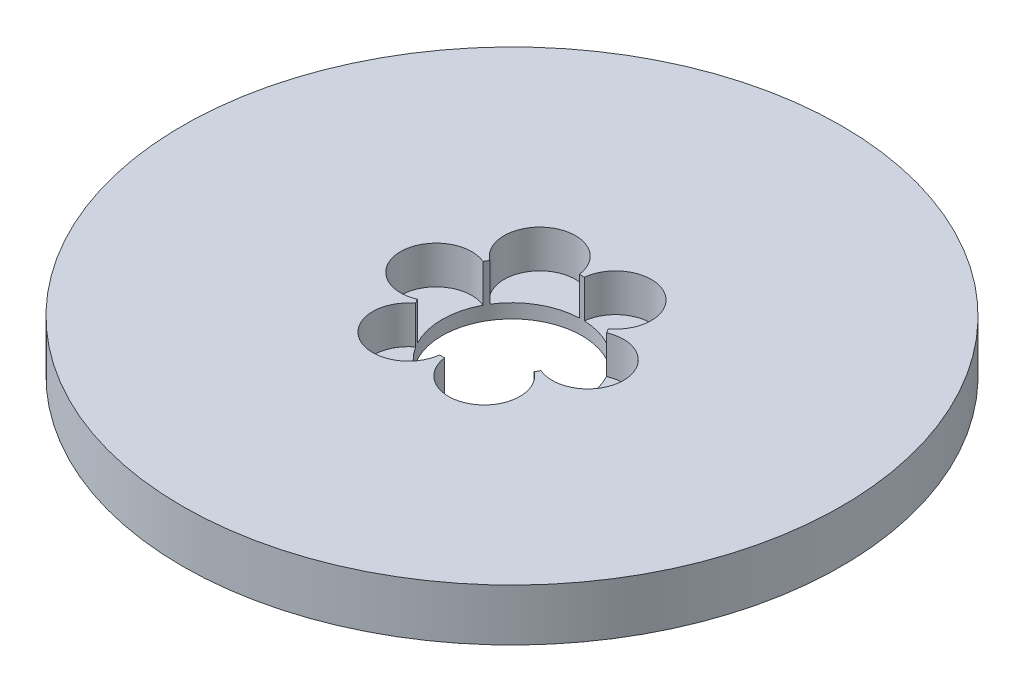
ISO-10303-21;
HEADER;
FILE_DESCRIPTION(('STEP AP214'),'2;1');
FILE_NAME('part.step','',(''),(''),'','','');
FILE_SCHEMA(('AUTOMOTIVE_DESIGN { 1 0 10303 214 1 1 1 1 }'));
ENDSEC;
DATA;
#1=APPLICATION_CONTEXT('core data for automotive mechanical design processes');
#2=APPLICATION_PROTOCOL_DEFINITION('international standard','automotive_design',2000,#1);
#3=PRODUCT_CONTEXT('',#1,'mechanical');
#4=PRODUCT('Part','Part','',(#3));
#5=PRODUCT_RELATED_PRODUCT_CATEGORY('part','',(#4));
#6=PRODUCT_DEFINITION_FORMATION('','',#4);
#7=PRODUCT_DEFINITION_CONTEXT('part definition',#1,'design');
#8=PRODUCT_DEFINITION('design','',#6,#7);
#9=PRODUCT_DEFINITION_SHAPE('','',#8);
#10=(LENGTH_UNIT() NAMED_UNIT(*) SI_UNIT(.MILLI.,.METRE.));
#11=(NAMED_UNIT(*) PLANE_ANGLE_UNIT() SI_UNIT($,.RADIAN.));
#12=(NAMED_UNIT(*) SI_UNIT($,.STERADIAN.) SOLID_ANGLE_UNIT());
#13=UNCERTAINTY_MEASURE_WITH_UNIT(LENGTH_MEASURE(1.E-05),#10,'distance_accuracy_value','');
#14=(GEOMETRIC_REPRESENTATION_CONTEXT(3) GLOBAL_UNCERTAINTY_ASSIGNED_CONTEXT((#13)) GLOBAL_UNIT_ASSIGNED_CONTEXT((#10,
#11,#12)) REPRESENTATION_CONTEXT('',''));
#15=CARTESIAN_POINT('',(0.,0.,0.));
#16=DIRECTION('',(0.,0.,1.));
#17=DIRECTION('',(1.,0.,0.));
#18=AXIS2_PLACEMENT_3D('',#15,#16,#17);
#19=CARTESIAN_POINT('',(0.,13.,0.));
#20=DIRECTION('',(0.,-1.,0.));
#21=DIRECTION('',(0.,0.,-1.));
#22=AXIS2_PLACEMENT_3D('',#19,#20,#21);
#23=CYLINDRICAL_SURFACE('',#22,82.5);
#24=CARTESIAN_POINT('',(0.,13.,0.));
#25=DIRECTION('',(0.,1.,0.));
#26=DIRECTION('',(0.,0.,1.));
#27=AXIS2_PLACEMENT_3D('',#24,#25,#26);
#28=CIRCLE('',#27,82.5);
#29=CARTESIAN_POINT('',(0.,13.,-82.5));
#30=VERTEX_POINT('',#29);
#31=EDGE_CURVE('E168',#30,#30,#28,.T.);
#32=CARTESIAN_POINT('',(0.,0.,0.));
#33=DIRECTION('',(0.,1.,0.));
#34=DIRECTION('',(0.,0.,1.));
#35=AXIS2_PLACEMENT_3D('',#32,#33,#34);
#36=CIRCLE('',#35,82.5);
#37=CARTESIAN_POINT('',(0.,0.,-82.5));
#38=VERTEX_POINT('',#37);
#39=EDGE_CURVE('E158',#38,#38,#36,.T.);
#40=CARTESIAN_POINT('',(0.,13.,-82.5));
#41=CARTESIAN_POINT('',(0.,12.8645833333333,-82.5));
#42=CARTESIAN_POINT('',(0.,12.7291666666667,-82.5));
#43=CARTESIAN_POINT('',(0.,12.4583333333333,-82.5));
#44=CARTESIAN_POINT('',(0.,12.3229166666667,-82.5));
#45=CARTESIAN_POINT('',(0.,12.0520833333333,-82.5));
#46=CARTESIAN_POINT('',(0.,11.9166666666667,-82.5));
#47=CARTESIAN_POINT('',(0.,11.6458333333333,-82.5));
#48=CARTESIAN_POINT('',(0.,11.5104166666667,-82.5));
#49=CARTESIAN_POINT('',(0.,11.2395833333333,-82.5));
#50=CARTESIAN_POINT('',(0.,11.1041666666667,-82.5));
#51=CARTESIAN_POINT('',(0.,10.8333333333333,-82.5));
#52=CARTESIAN_POINT('',(0.,10.6979166666667,-82.5));
#53=CARTESIAN_POINT('',(0.,10.4270833333333,-82.5));
#54=CARTESIAN_POINT('',(0.,10.2916666666667,-82.5));
#55=CARTESIAN_POINT('',(0.,10.0208333333333,-82.5));
#56=CARTESIAN_POINT('',(0.,9.88541666666667,-82.5));
#57=CARTESIAN_POINT('',(0.,9.61458333333333,-82.5));
#58=CARTESIAN_POINT('',(0.,9.47916666666667,-82.5));
#59=CARTESIAN_POINT('',(0.,9.20833333333333,-82.5));
#60=CARTESIAN_POINT('',(0.,9.07291666666667,-82.5));
#61=CARTESIAN_POINT('',(0.,8.80208333333333,-82.5));
#62=CARTESIAN_POINT('',(0.,8.66666666666667,-82.5));
#63=CARTESIAN_POINT('',(0.,8.39583333333333,-82.5));
#64=CARTESIAN_POINT('',(0.,8.26041666666667,-82.5));
#65=CARTESIAN_POINT('',(0.,7.98958333333333,-82.5));
#66=CARTESIAN_POINT('',(0.,7.85416666666667,-82.5));
#67=CARTESIAN_POINT('',(0.,7.58333333333333,-82.5));
#68=CARTESIAN_POINT('',(0.,7.44791666666667,-82.5));
#69=CARTESIAN_POINT('',(0.,7.17708333333333,-82.5));
#70=CARTESIAN_POINT('',(0.,7.04166666666667,-82.5));
#71=CARTESIAN_POINT('',(0.,6.77083333333333,-82.5));
#72=CARTESIAN_POINT('',(0.,6.63541666666667,-82.5));
#73=CARTESIAN_POINT('',(0.,6.36458333333333,-82.5));
#74=CARTESIAN_POINT('',(0.,6.22916666666667,-82.5));
#75=CARTESIAN_POINT('',(0.,5.95833333333333,-82.5));
#76=CARTESIAN_POINT('',(0.,5.82291666666667,-82.5));
#77=CARTESIAN_POINT('',(0.,5.55208333333333,-82.5));
#78=CARTESIAN_POINT('',(0.,5.41666666666667,-82.5));
#79=CARTESIAN_POINT('',(0.,5.14583333333333,-82.5));
#80=CARTESIAN_POINT('',(0.,5.01041666666667,-82.5));
#81=CARTESIAN_POINT('',(0.,4.73958333333333,-82.5));
#82=CARTESIAN_POINT('',(0.,4.60416666666667,-82.5));
#83=CARTESIAN_POINT('',(0.,4.33333333333333,-82.5));
#84=CARTESIAN_POINT('',(0.,4.19791666666667,-82.5));
#85=CARTESIAN_POINT('',(0.,3.92708333333333,-82.5));
#86=CARTESIAN_POINT('',(0.,3.79166666666667,-82.5));
#87=CARTESIAN_POINT('',(0.,3.52083333333333,-82.5));
#88=CARTESIAN_POINT('',(0.,3.38541666666667,-82.5));
#89=CARTESIAN_POINT('',(0.,3.11458333333333,-82.5));
#90=CARTESIAN_POINT('',(0.,2.97916666666667,-82.5));
#91=CARTESIAN_POINT('',(0.,2.70833333333333,-82.5));
#92=CARTESIAN_POINT('',(0.,2.57291666666667,-82.5));
#93=CARTESIAN_POINT('',(0.,2.30208333333333,-82.5));
#94=CARTESIAN_POINT('',(0.,2.16666666666667,-82.5));
#95=CARTESIAN_POINT('',(0.,1.89583333333333,-82.5));
#96=CARTESIAN_POINT('',(0.,1.76041666666667,-82.5));
#97=CARTESIAN_POINT('',(0.,1.48958333333333,-82.5));
#98=CARTESIAN_POINT('',(0.,1.35416666666667,-82.5));
#99=CARTESIAN_POINT('',(0.,1.08333333333333,-82.5));
#100=CARTESIAN_POINT('',(0.,0.947916666666667,-82.5));
#101=CARTESIAN_POINT('',(0.,0.677083333333334,-82.5));
#102=CARTESIAN_POINT('',(0.,0.541666666666667,-82.5));
#103=CARTESIAN_POINT('',(0.,0.270833333333334,-82.5));
#104=CARTESIAN_POINT('',(0.,0.135416666666667,-82.5));
#105=CARTESIAN_POINT('',(0.,0.,-82.5));
#106=B_SPLINE_CURVE_WITH_KNOTS('',3,(#40,#41,#42,#43,#44,#45,#46,#47,#48,#49,#50,#51,#52,#53,
#54,#55,#56,#57,#58,#59,#60,#61,#62,#63,#64,#65,#66,#67,#68,#69,#70,#71,#72,#73,#74,#75,#76,#77,
#78,#79,#80,#81,#82,#83,#84,#85,#86,#87,#88,#89,#90,#91,#92,#93,#94,#95,#96,#97,#98,#99,#100,
#101,#102,#103,#104,#105),.UNSPECIFIED.,.F.,.F.,(4,2,2,2,2,2,2,2,2,2,2,2,2,2,2,2,2,2,2,2,2,2,2,
2,2,2,2,2,2,2,2,2,4),(0.,0.406249999999999,0.812499999999999,1.21875,1.625,2.03125,2.4375,
2.84375,3.25,3.65625,4.0625,4.46875,4.875,5.28125,5.6875,6.09375,6.5,6.90625,7.3125,7.71875,
8.125,8.53125,8.9375,9.34375,9.75,10.15625,10.5625,10.96875,11.375,11.78125,12.1875,12.59375,
13.),.UNSPECIFIED.);
#107=EDGE_CURVE('BSEAM39',#30,#38,#106,.T.);
#108=ORIENTED_EDGE('',*,*,#31,.F.);
#109=ORIENTED_EDGE('',*,*,#39,.T.);
#110=ORIENTED_EDGE('',*,*,#107,.T.);
#111=ORIENTED_EDGE('',*,*,#107,.F.);
#112=EDGE_LOOP('',(#108,#110,#109,#111));
#113=FACE_BOUND('',#112,.T.);
#114=ADVANCED_FACE('F39',(#113),#23,.T.);
#115=CARTESIAN_POINT('',(0.,13.,0.));
#116=DIRECTION('',(0.,1.,0.));
#117=DIRECTION('',(0.,0.,1.));
#118=AXIS2_PLACEMENT_3D('',#115,#116,#117);
#119=PLANE('',#118);
#120=CARTESIAN_POINT('',(18.9891539759738,13.,0.));
#121=DIRECTION('',(0.,1.,0.));
#122=DIRECTION('',(0.,0.,-1.));
#123=AXIS2_PLACEMENT_3D('',#120,#121,#122);
#124=CIRCLE('',#123,8.93165951929688);
#125=CARTESIAN_POINT('',(15.4578615692248,13.,8.20393294138144));
#126=VERTEX_POINT('',#125);
#127=CARTESIAN_POINT('',(15.4578615692248,13.,-8.20393294138144));
#128=VERTEX_POINT('',#127);
#129=EDGE_CURVE('E212',#126,#128,#124,.T.);
#130=ORIENTED_EDGE('',*,*,#129,.F.);
#131=CARTESIAN_POINT('',(0.,13.,0.));
#132=DIRECTION('',(0.,1.,0.));
#133=DIRECTION('',(0.,0.,1.));
#134=AXIS2_PLACEMENT_3D('',#131,#132,#133);
#135=CIRCLE('',#134,17.5);
#136=CARTESIAN_POINT('',(14.8337451227928,13.,9.28493433644107));
#137=VERTEX_POINT('',#136);
#138=EDGE_CURVE('E156',#137,#126,#135,.T.);
#139=ORIENTED_EDGE('',*,*,#138,.F.);
#140=CARTESIAN_POINT('',(9.49457698798696,13.,16.4450897395675));
#141=DIRECTION('',(0.,1.,0.));
#142=DIRECTION('',(0.866025403784436,0.,-0.500000000000004));
#143=AXIS2_PLACEMENT_3D('',#140,#141,#142);
#144=CIRCLE('',#143,8.93165951929688);
#145=CARTESIAN_POINT('',(0.62411644643216,13.,17.4888672778226));
#146=VERTEX_POINT('',#145);
#147=EDGE_CURVE('E152',#146,#137,#144,.T.);
#148=ORIENTED_EDGE('',*,*,#147,.F.);
#149=CARTESIAN_POINT('',(-0.624116446432038,13.,17.4888672778226));
#150=VERTEX_POINT('',#149);
#151=EDGE_CURVE('E148',#150,#146,#135,.T.);
#152=ORIENTED_EDGE('',*,*,#151,.F.);
#153=CARTESIAN_POINT('',(-9.49457698798685,13.,16.4450897395676));
#154=DIRECTION('',(0.,1.,0.));
#155=DIRECTION('',(0.86602540378444,0.,0.499999999999998));
#156=AXIS2_PLACEMENT_3D('',#153,#154,#155);
#157=CIRCLE('',#156,8.93165951929688);
#158=CARTESIAN_POINT('',(-14.8337451227927,13.,9.28493433644117));
#159=VERTEX_POINT('',#158);
#160=EDGE_CURVE('E127',#159,#150,#157,.T.);
#161=ORIENTED_EDGE('',*,*,#160,.F.);
#162=CARTESIAN_POINT('',(-15.4578615692248,13.,8.20393294138144));
#163=VERTEX_POINT('',#162);
#164=EDGE_CURVE('E154',#163,#159,#135,.T.);
#165=ORIENTED_EDGE('',*,*,#164,.F.);
#166=CARTESIAN_POINT('',(-18.9891539759738,13.,0.));
#167=DIRECTION('',(0.,1.,0.));
#168=DIRECTION('',(0.,0.,1.));
#169=AXIS2_PLACEMENT_3D('',#166,#167,#168);
#170=CIRCLE('',#169,8.93165951929688);
#171=CARTESIAN_POINT('',(-15.4578615692248,13.,-8.20393294138144));
#172=VERTEX_POINT('',#171);
#173=EDGE_CURVE('E163',#172,#163,#170,.T.);
#174=ORIENTED_EDGE('',*,*,#173,.F.);
#175=CARTESIAN_POINT('',(-14.8337451227928,13.,-9.28493433644096));
#176=VERTEX_POINT('',#175);
#177=EDGE_CURVE('E157',#176,#172,#135,.T.);
#178=ORIENTED_EDGE('',*,*,#177,.F.);
#179=CARTESIAN_POINT('',(-9.49457698798708,13.,-16.4450897395675));
#180=DIRECTION('',(0.,1.,0.));
#181=DIRECTION('',(-0.866025403784433,0.,0.50000000000001));
#182=AXIS2_PLACEMENT_3D('',#179,#180,#181);
#183=CIRCLE('',#182,8.93165951929688);
#184=CARTESIAN_POINT('',(-0.624116446432283,13.,-17.4888672778226));
#185=VERTEX_POINT('',#184);
#186=EDGE_CURVE('E371',#185,#176,#183,.T.);
#187=ORIENTED_EDGE('',*,*,#186,.F.);
#188=CARTESIAN_POINT('',(0.624116446431915,13.,-17.4888672778226));
#189=VERTEX_POINT('',#188);
#190=EDGE_CURVE('E378',#189,#185,#135,.T.);
#191=ORIENTED_EDGE('',*,*,#190,.F.);
#192=CARTESIAN_POINT('',(9.49457698798673,13.,-16.4450897395677));
#193=DIRECTION('',(0.,1.,0.));
#194=DIRECTION('',(-0.866025403784443,0.,-0.499999999999992));
#195=AXIS2_PLACEMENT_3D('',#192,#193,#194);
#196=CIRCLE('',#195,8.93165951929688);
#197=CARTESIAN_POINT('',(14.8337451227926,13.,-9.28493433644128));
#198=VERTEX_POINT('',#197);
#199=EDGE_CURVE('E392',#198,#189,#196,.T.);
#200=ORIENTED_EDGE('',*,*,#199,.F.);
#201=EDGE_CURVE('E161',#128,#198,#135,.T.);
#202=ORIENTED_EDGE('',*,*,#201,.F.);
#203=EDGE_LOOP('',(#130,#139,#148,#152,#161,#165,#174,#178,#187,#191,#200,#202));
#204=FACE_BOUND('',#203,.T.);
#205=ORIENTED_EDGE('',*,*,#31,.T.);
#206=EDGE_LOOP('',(#205));
#207=FACE_BOUND('',#206,.T.);
#208=ADVANCED_FACE('F151',(#204,#207),#119,.T.);
#209=CARTESIAN_POINT('',(0.,0.,0.));
#210=DIRECTION('',(0.,1.,0.));
#211=DIRECTION('',(0.,0.,1.));
#212=AXIS2_PLACEMENT_3D('',#209,#210,#211);
#213=PLANE('',#212);
#214=CARTESIAN_POINT('',(0.,0.,0.));
#215=DIRECTION('',(0.,1.,0.));
#216=DIRECTION('',(0.,0.,1.));
#217=AXIS2_PLACEMENT_3D('',#214,#215,#216);
#218=CIRCLE('',#217,17.5);
#219=CARTESIAN_POINT('',(0.,0.,17.5));
#220=VERTEX_POINT('',#219);
#221=EDGE_CURVE('E167',#220,#220,#218,.T.);
#222=ORIENTED_EDGE('',*,*,#221,.T.);
#223=EDGE_LOOP('',(#222));
#224=FACE_BOUND('',#223,.T.);
#225=ORIENTED_EDGE('',*,*,#39,.F.);
#226=EDGE_LOOP('',(#225));
#227=FACE_BOUND('',#226,.T.);
#228=ADVANCED_FACE('F235',(#224,#227),#213,.F.);
#229=CARTESIAN_POINT('',(0.,13.,0.));
#230=DIRECTION('',(0.,-1.,0.));
#231=DIRECTION('',(0.,0.,-1.));
#232=AXIS2_PLACEMENT_3D('',#229,#230,#231);
#233=CYLINDRICAL_SURFACE('',#232,17.5);
#234=DIRECTION('',(0.,1.,0.));
#235=VECTOR('',#234,1.);
#236=CARTESIAN_POINT('',(15.4578615692248,8.25643716433976,8.20393294138144));
#237=LINE('',#236,#235);
#238=CARTESIAN_POINT('',(15.4578615692248,3.51287432867953,8.20393294138144));
#239=VERTEX_POINT('',#238);
#240=EDGE_CURVE('E11',#239,#126,#237,.T.);
#241=ORIENTED_EDGE('',*,*,#240,.F.);
#242=CARTESIAN_POINT('',(0.,3.51287432867953,0.));
#243=DIRECTION('',(0.,1.,0.));
#244=DIRECTION('',(0.,0.,1.));
#245=AXIS2_PLACEMENT_3D('',#242,#243,#244);
#246=CIRCLE('',#245,17.5);
#247=CARTESIAN_POINT('',(15.4578615692248,3.51287432867953,-8.20393294138144));
#248=VERTEX_POINT('',#247);
#249=EDGE_CURVE('E207',#239,#248,#246,.T.);
#250=ORIENTED_EDGE('',*,*,#249,.T.);
#251=DIRECTION('',(0.,1.,0.));
#252=VECTOR('',#251,1.);
#253=CARTESIAN_POINT('',(15.4578615692248,8.25643716433976,-8.20393294138144));
#254=LINE('',#253,#252);
#255=EDGE_CURVE('E46',#128,#248,#254,.F.);
#256=ORIENTED_EDGE('',*,*,#255,.F.);
#257=ORIENTED_EDGE('',*,*,#201,.T.);
#258=DIRECTION('',(0.,1.,0.));
#259=VECTOR('',#258,1.);
#260=CARTESIAN_POINT('',(14.8337451227926,8.25643716433976,-9.28493433644128));
#261=LINE('',#260,#259);
#262=CARTESIAN_POINT('',(14.8337451227926,3.51287432867953,-9.28493433644128));
#263=VERTEX_POINT('',#262);
#264=EDGE_CURVE('E199',#263,#198,#261,.T.);
#265=ORIENTED_EDGE('',*,*,#264,.F.);
#266=CARTESIAN_POINT('',(0.,3.51287432867953,0.));
#267=DIRECTION('',(0.,1.,0.));
#268=DIRECTION('',(0.,0.,1.));
#269=AXIS2_PLACEMENT_3D('',#266,#267,#268);
#270=CIRCLE('',#269,17.5);
#271=CARTESIAN_POINT('',(0.624116446431915,3.51287432867953,-17.4888672778226));
#272=VERTEX_POINT('',#271);
#273=EDGE_CURVE('E193',#263,#272,#270,.T.);
#274=ORIENTED_EDGE('',*,*,#273,.T.);
#275=DIRECTION('',(0.,1.,0.));
#276=VECTOR('',#275,1.);
#277=CARTESIAN_POINT('',(0.624116446431915,8.25643716433976,-17.4888672778226));
#278=LINE('',#277,#276);
#279=EDGE_CURVE('E197',#189,#272,#278,.F.);
#280=ORIENTED_EDGE('',*,*,#279,.F.);
#281=ORIENTED_EDGE('',*,*,#190,.T.);
#282=DIRECTION('',(0.,1.,0.));
#283=VECTOR('',#282,1.);
#284=CARTESIAN_POINT('',(-0.624116446432283,8.25643716433976,-17.4888672778226));
#285=LINE('',#284,#283);
#286=CARTESIAN_POINT('',(-0.624116446432283,3.51287432867953,-17.4888672778226));
#287=VERTEX_POINT('',#286);
#288=EDGE_CURVE('E195',#287,#185,#285,.T.);
#289=ORIENTED_EDGE('',*,*,#288,.F.);
#290=CARTESIAN_POINT('',(0.,3.51287432867953,0.));
#291=DIRECTION('',(0.,1.,0.));
#292=DIRECTION('',(0.,0.,1.));
#293=AXIS2_PLACEMENT_3D('',#290,#291,#292);
#294=CIRCLE('',#293,17.5);
#295=CARTESIAN_POINT('',(-14.8337451227928,3.51287432867953,-9.28493433644096));
#296=VERTEX_POINT('',#295);
#297=EDGE_CURVE('E186',#287,#296,#294,.T.);
#298=ORIENTED_EDGE('',*,*,#297,.T.);
#299=DIRECTION('',(0.,1.,0.));
#300=VECTOR('',#299,1.);
#301=CARTESIAN_POINT('',(-14.8337451227928,8.25643716433976,-9.28493433644096));
#302=LINE('',#301,#300);
#303=EDGE_CURVE('E188',#176,#296,#302,.F.);
#304=ORIENTED_EDGE('',*,*,#303,.F.);
#305=ORIENTED_EDGE('',*,*,#177,.T.);
#306=DIRECTION('',(0.,1.,0.));
#307=VECTOR('',#306,1.);
#308=CARTESIAN_POINT('',(-15.4578615692248,8.25643716433976,-8.20393294138144));
#309=LINE('',#308,#307);
#310=CARTESIAN_POINT('',(-15.4578615692248,3.51287432867953,-8.20393294138144));
#311=VERTEX_POINT('',#310);
#312=EDGE_CURVE('E182',#311,#172,#309,.T.);
#313=ORIENTED_EDGE('',*,*,#312,.F.);
#314=CARTESIAN_POINT('',(0.,3.51287432867953,0.));
#315=DIRECTION('',(0.,1.,0.));
#316=DIRECTION('',(0.,0.,1.));
#317=AXIS2_PLACEMENT_3D('',#314,#315,#316);
#318=CIRCLE('',#317,17.5);
#319=CARTESIAN_POINT('',(-15.4578615692248,3.51287432867953,8.20393294138144));
#320=VERTEX_POINT('',#319);
#321=EDGE_CURVE('E172',#311,#320,#318,.T.);
#322=ORIENTED_EDGE('',*,*,#321,.T.);
#323=DIRECTION('',(0.,1.,0.));
#324=VECTOR('',#323,1.);
#325=CARTESIAN_POINT('',(-15.4578615692248,8.25643716433976,8.20393294138144));
#326=LINE('',#325,#324);
#327=EDGE_CURVE('E177',#163,#320,#326,.F.);
#328=ORIENTED_EDGE('',*,*,#327,.F.);
#329=ORIENTED_EDGE('',*,*,#164,.T.);
#330=DIRECTION('',(0.,1.,0.));
#331=VECTOR('',#330,1.);
#332=CARTESIAN_POINT('',(-14.8337451227927,8.25643716433976,9.28493433644117));
#333=LINE('',#332,#331);
#334=CARTESIAN_POINT('',(-14.8337451227927,3.51287432867953,9.28493433644117));
#335=VERTEX_POINT('',#334);
#336=EDGE_CURVE('E132',#335,#159,#333,.T.);
#337=ORIENTED_EDGE('',*,*,#336,.F.);
#338=CARTESIAN_POINT('',(0.,3.51287432867953,0.));
#339=DIRECTION('',(0.,1.,0.));
#340=DIRECTION('',(0.,0.,1.));
#341=AXIS2_PLACEMENT_3D('',#338,#339,#340);
#342=CIRCLE('',#341,17.5);
#343=CARTESIAN_POINT('',(-0.624116446432038,3.51287432867953,17.4888672778226));
#344=VERTEX_POINT('',#343);
#345=EDGE_CURVE('E150',#335,#344,#342,.T.);
#346=ORIENTED_EDGE('',*,*,#345,.T.);
#347=DIRECTION('',(0.,1.,0.));
#348=VECTOR('',#347,1.);
#349=CARTESIAN_POINT('',(-0.624116446432036,8.25643716433976,17.4888672778226));
#350=LINE('',#349,#348);
#351=EDGE_CURVE('E128',#150,#344,#350,.F.);
#352=ORIENTED_EDGE('',*,*,#351,.F.);
#353=ORIENTED_EDGE('',*,*,#151,.T.);
#354=DIRECTION('',(0.,1.,0.));
#355=VECTOR('',#354,1.);
#356=CARTESIAN_POINT('',(0.624116446432161,8.25643716433976,17.4888672778226));
#357=LINE('',#356,#355);
#358=CARTESIAN_POINT('',(0.62411644643216,3.51287432867953,17.4888672778226));
#359=VERTEX_POINT('',#358);
#360=EDGE_CURVE('E210',#359,#146,#357,.T.);
#361=ORIENTED_EDGE('',*,*,#360,.F.);
#362=CARTESIAN_POINT('',(0.,3.51287432867953,0.));
#363=DIRECTION('',(0.,1.,0.));
#364=DIRECTION('',(0.,0.,1.));
#365=AXIS2_PLACEMENT_3D('',#362,#363,#364);
#366=CIRCLE('',#365,17.5);
#367=CARTESIAN_POINT('',(14.8337451227928,3.51287432867953,9.28493433644107));
#368=VERTEX_POINT('',#367);
#369=EDGE_CURVE('E205',#359,#368,#366,.T.);
#370=ORIENTED_EDGE('',*,*,#369,.T.);
#371=DIRECTION('',(0.,1.,0.));
#372=VECTOR('',#371,1.);
#373=CARTESIAN_POINT('',(14.8337451227928,8.25643716433976,9.28493433644107));
#374=LINE('',#373,#372);
#375=EDGE_CURVE('E202',#137,#368,#374,.F.);
#376=ORIENTED_EDGE('',*,*,#375,.F.);
#377=ORIENTED_EDGE('',*,*,#138,.T.);
#378=EDGE_LOOP('',(#241,#250,#256,#257,#265,#274,#280,#281,#289,#298,#304,#305,#313,#322,#328,
#329,#337,#346,#352,#353,#361,#370,#376,#377));
#379=FACE_BOUND('',#378,.T.);
#380=ORIENTED_EDGE('',*,*,#221,.F.);
#381=EDGE_LOOP('',(#380));
#382=FACE_BOUND('',#381,.T.);
#383=ADVANCED_FACE('F141',(#379,#382),#233,.F.);
#384=CARTESIAN_POINT('',(-18.9891539759738,3.51287432867953,0.));
#385=DIRECTION('',(0.,1.,0.));
#386=DIRECTION('',(0.,0.,1.));
#387=AXIS2_PLACEMENT_3D('',#384,#385,#386);
#388=CYLINDRICAL_SURFACE('',#387,8.93165951929688);
#389=ORIENTED_EDGE('',*,*,#312,.T.);
#390=ORIENTED_EDGE('',*,*,#173,.T.);
#391=ORIENTED_EDGE('',*,*,#327,.T.);
#392=CARTESIAN_POINT('',(-18.9891539759738,3.51287432867953,0.));
#393=DIRECTION('',(0.,1.,0.));
#394=DIRECTION('',(0.,0.,1.));
#395=AXIS2_PLACEMENT_3D('',#392,#393,#394);
#396=CIRCLE('',#395,8.93165951929688);
#397=EDGE_CURVE('E166',#311,#320,#396,.T.);
#398=ORIENTED_EDGE('',*,*,#397,.F.);
#399=EDGE_LOOP('',(#389,#390,#391,#398));
#400=FACE_BOUND('',#399,.T.);
#401=ADVANCED_FACE('F242',(#400),#388,.F.);
#402=CARTESIAN_POINT('',(-18.9891539759738,3.51287432867953,0.));
#403=DIRECTION('',(0.,1.,0.));
#404=DIRECTION('',(0.,0.,1.));
#405=AXIS2_PLACEMENT_3D('',#402,#403,#404);
#406=PLANE('',#405);
#407=ORIENTED_EDGE('',*,*,#397,.T.);
#408=ORIENTED_EDGE('',*,*,#321,.F.);
#409=EDGE_LOOP('',(#407,#408));
#410=FACE_BOUND('',#409,.T.);
#411=ADVANCED_FACE('F250',(#410),#406,.T.);
#412=CARTESIAN_POINT('',(-9.49457698798685,3.51287432867953,16.4450897395676));
#413=DIRECTION('',(0.,1.,0.));
#414=DIRECTION('',(0.,0.,1.));
#415=AXIS2_PLACEMENT_3D('',#412,#413,#414);
#416=CYLINDRICAL_SURFACE('',#415,8.93165951929688);
#417=ORIENTED_EDGE('',*,*,#336,.T.);
#418=ORIENTED_EDGE('',*,*,#160,.T.);
#419=ORIENTED_EDGE('',*,*,#351,.T.);
#420=CARTESIAN_POINT('',(-9.49457698798685,3.51287432867953,16.4450897395676));
#421=DIRECTION('',(0.,1.,0.));
#422=DIRECTION('',(0.86602540378444,0.,0.499999999999998));
#423=AXIS2_PLACEMENT_3D('',#420,#421,#422);
#424=CIRCLE('',#423,8.93165951929688);
#425=EDGE_CURVE('E137',#335,#344,#424,.T.);
#426=ORIENTED_EDGE('',*,*,#425,.F.);
#427=EDGE_LOOP('',(#417,#418,#419,#426));
#428=FACE_BOUND('',#427,.T.);
#429=ADVANCED_FACE('F126',(#428),#416,.F.);
#430=CARTESIAN_POINT('',(-9.49457698798685,3.51287432867953,16.4450897395676));
#431=DIRECTION('',(0.,1.,0.));
#432=DIRECTION('',(0.86602540378444,0.,0.499999999999998));
#433=AXIS2_PLACEMENT_3D('',#430,#431,#432);
#434=PLANE('',#433);
#435=ORIENTED_EDGE('',*,*,#425,.T.);
#436=ORIENTED_EDGE('',*,*,#345,.F.);
#437=EDGE_LOOP('',(#435,#436));
#438=FACE_BOUND('',#437,.T.);
#439=ADVANCED_FACE('F255',(#438),#434,.T.);
#440=CARTESIAN_POINT('',(-9.49457698798708,3.51287432867953,-16.4450897395675));
#441=DIRECTION('',(0.,1.,0.));
#442=DIRECTION('',(0.,0.,1.));
#443=AXIS2_PLACEMENT_3D('',#440,#441,#442);
#444=CYLINDRICAL_SURFACE('',#443,8.93165951929688);
#445=ORIENTED_EDGE('',*,*,#288,.T.);
#446=ORIENTED_EDGE('',*,*,#186,.T.);
#447=ORIENTED_EDGE('',*,*,#303,.T.);
#448=CARTESIAN_POINT('',(-9.49457698798708,3.51287432867953,-16.4450897395675));
#449=DIRECTION('',(0.,1.,0.));
#450=DIRECTION('',(-0.866025403784433,0.,0.50000000000001));
#451=AXIS2_PLACEMENT_3D('',#448,#449,#450);
#452=CIRCLE('',#451,8.93165951929688);
#453=EDGE_CURVE('E373',#287,#296,#452,.T.);
#454=ORIENTED_EDGE('',*,*,#453,.F.);
#455=EDGE_LOOP('',(#445,#446,#447,#454));
#456=FACE_BOUND('',#455,.T.);
#457=ADVANCED_FACE('F260',(#456),#444,.F.);
#458=CARTESIAN_POINT('',(-9.49457698798708,3.51287432867953,-16.4450897395675));
#459=DIRECTION('',(0.,1.,0.));
#460=DIRECTION('',(-0.866025403784433,0.,0.50000000000001));
#461=AXIS2_PLACEMENT_3D('',#458,#459,#460);
#462=PLANE('',#461);
#463=ORIENTED_EDGE('',*,*,#453,.T.);
#464=ORIENTED_EDGE('',*,*,#297,.F.);
#465=EDGE_LOOP('',(#463,#464));
#466=FACE_BOUND('',#465,.T.);
#467=ADVANCED_FACE('F301',(#466),#462,.T.);
#468=CARTESIAN_POINT('',(9.49457698798673,3.51287432867953,-16.4450897395677));
#469=DIRECTION('',(0.,1.,0.));
#470=DIRECTION('',(0.,0.,1.));
#471=AXIS2_PLACEMENT_3D('',#468,#469,#470);
#472=CYLINDRICAL_SURFACE('',#471,8.93165951929688);
#473=ORIENTED_EDGE('',*,*,#264,.T.);
#474=ORIENTED_EDGE('',*,*,#199,.T.);
#475=ORIENTED_EDGE('',*,*,#279,.T.);
#476=CARTESIAN_POINT('',(9.49457698798673,3.51287432867953,-16.4450897395677));
#477=DIRECTION('',(0.,1.,0.));
#478=DIRECTION('',(-0.866025403784443,0.,-0.499999999999992));
#479=AXIS2_PLACEMENT_3D('',#476,#477,#478);
#480=CIRCLE('',#479,8.93165951929688);
#481=EDGE_CURVE('E388',#263,#272,#480,.T.);
#482=ORIENTED_EDGE('',*,*,#481,.F.);
#483=EDGE_LOOP('',(#473,#474,#475,#482));
#484=FACE_BOUND('',#483,.T.);
#485=ADVANCED_FACE('F295',(#484),#472,.F.);
#486=CARTESIAN_POINT('',(9.49457698798673,3.51287432867953,-16.4450897395677));
#487=DIRECTION('',(0.,1.,0.));
#488=DIRECTION('',(-0.866025403784443,0.,-0.499999999999992));
#489=AXIS2_PLACEMENT_3D('',#486,#487,#488);
#490=PLANE('',#489);
#491=ORIENTED_EDGE('',*,*,#481,.T.);
#492=ORIENTED_EDGE('',*,*,#273,.F.);
#493=EDGE_LOOP('',(#491,#492));
#494=FACE_BOUND('',#493,.T.);
#495=ADVANCED_FACE('F265',(#494),#490,.T.);
#496=CARTESIAN_POINT('',(9.49457698798696,3.51287432867953,16.4450897395675));
#497=DIRECTION('',(0.,1.,0.));
#498=DIRECTION('',(0.,0.,1.));
#499=AXIS2_PLACEMENT_3D('',#496,#497,#498);
#500=CYLINDRICAL_SURFACE('',#499,8.93165951929688);
#501=ORIENTED_EDGE('',*,*,#360,.T.);
#502=ORIENTED_EDGE('',*,*,#147,.T.);
#503=ORIENTED_EDGE('',*,*,#375,.T.);
#504=CARTESIAN_POINT('',(9.49457698798696,3.51287432867953,16.4450897395675));
#505=DIRECTION('',(0.,1.,0.));
#506=DIRECTION('',(0.866025403784436,0.,-0.500000000000004));
#507=AXIS2_PLACEMENT_3D('',#504,#505,#506);
#508=CIRCLE('',#507,8.93165951929688);
#509=EDGE_CURVE('E56',#359,#368,#508,.T.);
#510=ORIENTED_EDGE('',*,*,#509,.F.);
#511=EDGE_LOOP('',(#501,#502,#503,#510));
#512=FACE_BOUND('',#511,.T.);
#513=ADVANCED_FACE('F259',(#512),#500,.F.);
#514=CARTESIAN_POINT('',(9.49457698798696,3.51287432867953,16.4450897395675));
#515=DIRECTION('',(0.,1.,0.));
#516=DIRECTION('',(0.866025403784436,0.,-0.500000000000004));
#517=AXIS2_PLACEMENT_3D('',#514,#515,#516);
#518=PLANE('',#517);
#519=ORIENTED_EDGE('',*,*,#509,.T.);
#520=ORIENTED_EDGE('',*,*,#369,.F.);
#521=EDGE_LOOP('',(#519,#520));
#522=FACE_BOUND('',#521,.T.);
#523=ADVANCED_FACE('F224',(#522),#518,.T.);
#524=CARTESIAN_POINT('',(18.9891539759738,3.51287432867953,0.));
#525=DIRECTION('',(0.,1.,0.));
#526=DIRECTION('',(0.,0.,1.));
#527=AXIS2_PLACEMENT_3D('',#524,#525,#526);
#528=CYLINDRICAL_SURFACE('',#527,8.93165951929688);
#529=ORIENTED_EDGE('',*,*,#240,.T.);
#530=ORIENTED_EDGE('',*,*,#129,.T.);
#531=ORIENTED_EDGE('',*,*,#255,.T.);
#532=CARTESIAN_POINT('',(18.9891539759738,3.51287432867953,0.));
#533=DIRECTION('',(0.,1.,0.));
#534=DIRECTION('',(0.,0.,-1.));
#535=AXIS2_PLACEMENT_3D('',#532,#533,#534);
#536=CIRCLE('',#535,8.93165951929688);
#537=EDGE_CURVE('E55',#239,#248,#536,.T.);
#538=ORIENTED_EDGE('',*,*,#537,.F.);
#539=EDGE_LOOP('',(#529,#530,#531,#538));
#540=FACE_BOUND('',#539,.T.);
#541=ADVANCED_FACE('F213',(#540),#528,.F.);
#542=CARTESIAN_POINT('',(18.9891539759738,3.51287432867953,0.));
#543=DIRECTION('',(0.,1.,0.));
#544=DIRECTION('',(0.,0.,-1.));
#545=AXIS2_PLACEMENT_3D('',#542,#543,#544);
#546=PLANE('',#545);
#547=ORIENTED_EDGE('',*,*,#537,.T.);
#548=ORIENTED_EDGE('',*,*,#249,.F.);
#549=EDGE_LOOP('',(#547,#548));
#550=FACE_BOUND('',#549,.T.);
#551=ADVANCED_FACE('F220',(#550),#546,.T.);
#552=CLOSED_SHELL('',(#114,#208,#228,#383,#401,#411,#429,#439,#457,#467,#485,#495,#513,#523,
#541,#551));
#553=MANIFOLD_SOLID_BREP('B2',#552);
#554=ADVANCED_BREP_SHAPE_REPRESENTATION('',(#18,#553),#14);
#555=SHAPE_DEFINITION_REPRESENTATION(#9,#554);
ENDSEC;
END-ISO-10303-21;
